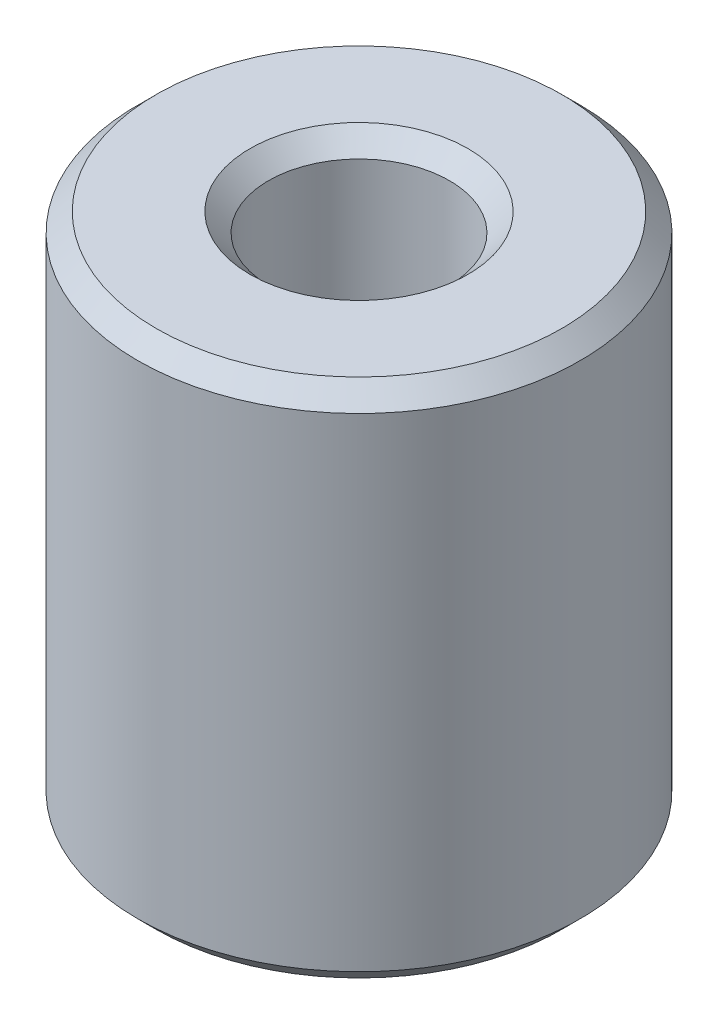
ISO-10303-21;
HEADER;
FILE_DESCRIPTION(('STEP AP214'),'2;1');
FILE_NAME('part.step','',(''),(''),'','','');
FILE_SCHEMA(('AUTOMOTIVE_DESIGN { 1 0 10303 214 1 1 1 1 }'));
ENDSEC;
DATA;
#1=APPLICATION_CONTEXT('core data for automotive mechanical design processes');
#2=APPLICATION_PROTOCOL_DEFINITION('international standard','automotive_design',2000,#1);
#3=PRODUCT_CONTEXT('',#1,'mechanical');
#4=PRODUCT('Part','Part','',(#3));
#5=PRODUCT_RELATED_PRODUCT_CATEGORY('part','',(#4));
#6=PRODUCT_DEFINITION_FORMATION('','',#4);
#7=PRODUCT_DEFINITION_CONTEXT('part definition',#1,'design');
#8=PRODUCT_DEFINITION('design','',#6,#7);
#9=PRODUCT_DEFINITION_SHAPE('','',#8);
#10=(LENGTH_UNIT() NAMED_UNIT(*) SI_UNIT(.MILLI.,.METRE.));
#11=(NAMED_UNIT(*) PLANE_ANGLE_UNIT() SI_UNIT($,.RADIAN.));
#12=(NAMED_UNIT(*) SI_UNIT($,.STERADIAN.) SOLID_ANGLE_UNIT());
#13=UNCERTAINTY_MEASURE_WITH_UNIT(LENGTH_MEASURE(1.E-05),#10,'distance_accuracy_value','');
#14=(GEOMETRIC_REPRESENTATION_CONTEXT(3) GLOBAL_UNCERTAINTY_ASSIGNED_CONTEXT((#13)) GLOBAL_UNIT_ASSIGNED_CONTEXT((#10,
#11,#12)) REPRESENTATION_CONTEXT('',''));
#15=CARTESIAN_POINT('',(0.,0.,0.));
#16=DIRECTION('',(0.,0.,1.));
#17=DIRECTION('',(1.,0.,0.));
#18=AXIS2_PLACEMENT_3D('',#15,#16,#17);
#19=CARTESIAN_POINT('',(0.,88.202172089122,0.));
#20=DIRECTION('',(0.,-1.,0.));
#21=DIRECTION('',(0.,0.,-1.));
#22=AXIS2_PLACEMENT_3D('',#19,#20,#21);
#23=CYLINDRICAL_SURFACE('',#22,37.5);
#24=CARTESIAN_POINT('',(0.,3.13711709989274,0.));
#25=DIRECTION('',(0.,1.,0.));
#26=DIRECTION('',(0.,0.,1.));
#27=AXIS2_PLACEMENT_3D('',#24,#25,#26);
#28=CIRCLE('',#27,37.5);
#29=CARTESIAN_POINT('',(0.,3.13711709989274,37.5));
#30=VERTEX_POINT('',#29);
#31=EDGE_CURVE('E10',#30,#30,#28,.T.);
#32=ORIENTED_EDGE('',*,*,#31,.T.);
#33=EDGE_LOOP('',(#32));
#34=FACE_BOUND('',#33,.T.);
#35=CARTESIAN_POINT('',(0.,85.0650549892292,0.));
#36=DIRECTION('',(0.,1.,0.));
#37=DIRECTION('',(0.,0.,1.));
#38=AXIS2_PLACEMENT_3D('',#35,#36,#37);
#39=CIRCLE('',#38,37.5);
#40=CARTESIAN_POINT('',(0.,85.0650549892292,37.5));
#41=VERTEX_POINT('',#40);
#42=EDGE_CURVE('E50',#41,#41,#39,.F.);
#43=ORIENTED_EDGE('',*,*,#42,.T.);
#44=EDGE_LOOP('',(#43));
#45=FACE_BOUND('',#44,.T.);
#46=ADVANCED_FACE('F39',(#34,#45),#23,.T.);
#47=CARTESIAN_POINT('',(0.,88.202172089122,0.));
#48=DIRECTION('',(0.,1.,0.));
#49=DIRECTION('',(0.,0.,1.));
#50=AXIS2_PLACEMENT_3D('',#47,#48,#49);
#51=PLANE('',#50);
#52=CARTESIAN_POINT('',(0.,88.202172089122,0.));
#53=DIRECTION('',(0.,1.,0.));
#54=DIRECTION('',(0.,0.,1.));
#55=AXIS2_PLACEMENT_3D('',#52,#53,#54);
#56=CIRCLE('',#55,18.4767749365389);
#57=CARTESIAN_POINT('',(0.,88.202172089122,18.4767749365389));
#58=VERTEX_POINT('',#57);
#59=EDGE_CURVE('E58',#58,#58,#56,.F.);
#60=ORIENTED_EDGE('',*,*,#59,.T.);
#61=EDGE_LOOP('',(#60));
#62=FACE_BOUND('',#61,.T.);
#63=CARTESIAN_POINT('',(0.,88.202172089122,0.));
#64=DIRECTION('',(0.,1.,0.));
#65=DIRECTION('',(0.,0.,1.));
#66=AXIS2_PLACEMENT_3D('',#63,#64,#65);
#67=CIRCLE('',#66,34.3628829001073);
#68=CARTESIAN_POINT('',(0.,88.202172089122,34.3628829001073));
#69=VERTEX_POINT('',#68);
#70=EDGE_CURVE('E61',#69,#69,#67,.T.);
#71=ORIENTED_EDGE('',*,*,#70,.T.);
#72=EDGE_LOOP('',(#71));
#73=FACE_BOUND('',#72,.T.);
#74=ADVANCED_FACE('F88',(#62,#73),#51,.T.);
#75=CARTESIAN_POINT('',(0.,0.,0.));
#76=DIRECTION('',(0.,1.,0.));
#77=DIRECTION('',(0.,0.,1.));
#78=AXIS2_PLACEMENT_3D('',#75,#76,#77);
#79=PLANE('',#78);
#80=CARTESIAN_POINT('',(0.,0.,0.));
#81=DIRECTION('',(0.,1.,0.));
#82=DIRECTION('',(0.,0.,1.));
#83=AXIS2_PLACEMENT_3D('',#80,#81,#82);
#84=CIRCLE('',#83,18.4767749365388);
#85=CARTESIAN_POINT('',(0.,0.,18.4767749365388));
#86=VERTEX_POINT('',#85);
#87=EDGE_CURVE('E51',#86,#86,#84,.T.);
#88=ORIENTED_EDGE('',*,*,#87,.T.);
#89=EDGE_LOOP('',(#88));
#90=FACE_BOUND('',#89,.T.);
#91=CARTESIAN_POINT('',(0.,0.,0.));
#92=DIRECTION('',(0.,1.,0.));
#93=DIRECTION('',(0.,0.,1.));
#94=AXIS2_PLACEMENT_3D('',#91,#92,#93);
#95=CIRCLE('',#94,34.3628829001072);
#96=CARTESIAN_POINT('',(0.,0.,34.3628829001072));
#97=VERTEX_POINT('',#96);
#98=EDGE_CURVE('E54',#97,#97,#95,.F.);
#99=ORIENTED_EDGE('',*,*,#98,.T.);
#100=EDGE_LOOP('',(#99));
#101=FACE_BOUND('',#100,.T.);
#102=ADVANCED_FACE('F83',(#90,#101),#79,.F.);
#103=CARTESIAN_POINT('',(0.,88.202172089122,0.));
#104=DIRECTION('',(0.,-1.,0.));
#105=DIRECTION('',(0.,0.,-1.));
#106=AXIS2_PLACEMENT_3D('',#103,#104,#105);
#107=CYLINDRICAL_SURFACE('',#106,15.3396578366461);
#108=CARTESIAN_POINT('',(0.,85.0650549892292,0.));
#109=DIRECTION('',(0.,1.,0.));
#110=DIRECTION('',(0.,0.,1.));
#111=AXIS2_PLACEMENT_3D('',#108,#109,#110);
#112=CIRCLE('',#111,15.3396578366461);
#113=CARTESIAN_POINT('',(0.,85.0650549892292,15.3396578366461));
#114=VERTEX_POINT('',#113);
#115=EDGE_CURVE('E67',#114,#114,#112,.T.);
#116=ORIENTED_EDGE('',*,*,#115,.T.);
#117=EDGE_LOOP('',(#116));
#118=FACE_BOUND('',#117,.T.);
#119=CARTESIAN_POINT('',(0.,3.13711709989276,0.));
#120=DIRECTION('',(0.,1.,0.));
#121=DIRECTION('',(0.,0.,1.));
#122=AXIS2_PLACEMENT_3D('',#119,#120,#121);
#123=CIRCLE('',#122,15.3396578366461);
#124=CARTESIAN_POINT('',(0.,3.13711709989276,15.3396578366461));
#125=VERTEX_POINT('',#124);
#126=EDGE_CURVE('E69',#125,#125,#123,.F.);
#127=ORIENTED_EDGE('',*,*,#126,.T.);
#128=EDGE_LOOP('',(#127));
#129=FACE_BOUND('',#128,.T.);
#130=ADVANCED_FACE('F71',(#118,#129),#107,.F.);
#131=CARTESIAN_POINT('',(0.,85.0650549892292,0.));
#132=DIRECTION('',(0.,1.,0.));
#133=DIRECTION('',(0.,0.,1.));
#134=AXIS2_PLACEMENT_3D('',#131,#132,#133);
#135=CONICAL_SURFACE('',#134,15.3396578366461,0.785398163397453);
#136=CARTESIAN_POINT('',(0.,88.202172089122,18.4767749365389));
#137=CARTESIAN_POINT('',(0.,88.1694937859981,18.444096633415));
#138=CARTESIAN_POINT('',(0.,88.1368154828742,18.4114183302911));
#139=CARTESIAN_POINT('',(0.,88.0714588766265,18.3460617240434));
#140=CARTESIAN_POINT('',(0.,88.0387805735026,18.3133834209195));
#141=CARTESIAN_POINT('',(0.,87.9734239672548,18.2480268146717));
#142=CARTESIAN_POINT('',(0.,87.9407456641309,18.2153485115478));
#143=CARTESIAN_POINT('',(0.,87.8753890578832,18.1499919053001));
#144=CARTESIAN_POINT('',(0.,87.8427107547593,18.1173136021762));
#145=CARTESIAN_POINT('',(0.,87.7773541485115,18.0519569959284));
#146=CARTESIAN_POINT('',(0.,87.7446758453876,18.0192786928045));
#147=CARTESIAN_POINT('',(0.,87.6793192391399,17.9539220865568));
#148=CARTESIAN_POINT('',(0.,87.646640936016,17.9212437834329));
#149=CARTESIAN_POINT('',(0.,87.5812843297682,17.8558871771851));
#150=CARTESIAN_POINT('',(0.,87.5486060266443,17.8232088740612));
#151=CARTESIAN_POINT('',(0.,87.4832494203966,17.7578522678135));
#152=CARTESIAN_POINT('',(0.,87.4505711172727,17.7251739646896));
#153=CARTESIAN_POINT('',(0.,87.3852145110249,17.6598173584418));
#154=CARTESIAN_POINT('',(0.,87.352536207901,17.6271390553179));
#155=CARTESIAN_POINT('',(0.,87.2871796016533,17.5617824490702));
#156=CARTESIAN_POINT('',(0.,87.2545012985294,17.5291041459463));
#157=CARTESIAN_POINT('',(0.,87.1891446922816,17.4637475396985));
#158=CARTESIAN_POINT('',(0.,87.1564663891577,17.4310692365746));
#159=CARTESIAN_POINT('',(0.,87.09110978291,17.3657126303269));
#160=CARTESIAN_POINT('',(0.,87.0584314797861,17.333034327203));
#161=CARTESIAN_POINT('',(0.,86.9930748735383,17.2676777209552));
#162=CARTESIAN_POINT('',(0.,86.9603965704144,17.2349994178313));
#163=CARTESIAN_POINT('',(0.,86.8950399641667,17.1696428115836));
#164=CARTESIAN_POINT('',(0.,86.8623616610428,17.1369645084597));
#165=CARTESIAN_POINT('',(0.,86.797005054795,17.0716079022119));
#166=CARTESIAN_POINT('',(0.,86.7643267516711,17.038929599088));
#167=CARTESIAN_POINT('',(0.,86.6989701454234,16.9735729928403));
#168=CARTESIAN_POINT('',(0.,86.6662918422995,16.9408946897164));
#169=CARTESIAN_POINT('',(0.,86.6009352360517,16.8755380834686));
#170=CARTESIAN_POINT('',(0.,86.5682569329278,16.8428597803447));
#171=CARTESIAN_POINT('',(0.,86.5029003266801,16.777503174097));
#172=CARTESIAN_POINT('',(0.,86.4702220235562,16.7448248709731));
#173=CARTESIAN_POINT('',(0.,86.4048654173084,16.6794682647253));
#174=CARTESIAN_POINT('',(0.,86.3721871141845,16.6467899616014));
#175=CARTESIAN_POINT('',(0.,86.3068305079368,16.5814333553537));
#176=CARTESIAN_POINT('',(0.,86.2741522048129,16.5487550522298));
#177=CARTESIAN_POINT('',(0.,86.2087955985651,16.483398445982));
#178=CARTESIAN_POINT('',(0.,86.1761172954412,16.4507201428581));
#179=CARTESIAN_POINT('',(0.,86.1107606891935,16.3853635366104));
#180=CARTESIAN_POINT('',(0.,86.0780823860696,16.3526852334865));
#181=CARTESIAN_POINT('',(0.,86.0127257798218,16.2873286272387));
#182=CARTESIAN_POINT('',(0.,85.9800474766979,16.2546503241148));
#183=CARTESIAN_POINT('',(0.,85.9146908704502,16.1892937178671));
#184=CARTESIAN_POINT('',(0.,85.8820125673263,16.1566154147432));
#185=CARTESIAN_POINT('',(0.,85.8166559610785,16.0912588084954));
#186=CARTESIAN_POINT('',(0.,85.7839776579547,16.0585805053715));
#187=CARTESIAN_POINT('',(0.,85.7186210517069,15.9932238991238));
#188=CARTESIAN_POINT('',(0.,85.685942748583,15.9605455959999));
#189=CARTESIAN_POINT('',(0.,85.6205861423352,15.8951889897521));
#190=CARTESIAN_POINT('',(0.,85.5879078392113,15.8625106866282));
#191=CARTESIAN_POINT('',(0.,85.5225512329636,15.7971540803805));
#192=CARTESIAN_POINT('',(0.,85.4898729298397,15.7644757772566));
#193=CARTESIAN_POINT('',(0.,85.4245163235919,15.6991191710088));
#194=CARTESIAN_POINT('',(0.,85.3918380204681,15.6664408678849));
#195=CARTESIAN_POINT('',(0.,85.3264814142203,15.6010842616372));
#196=CARTESIAN_POINT('',(0.,85.2938031110964,15.5684059585133));
#197=CARTESIAN_POINT('',(0.,85.2284465048486,15.5030493522655));
#198=CARTESIAN_POINT('',(0.,85.1957682017247,15.4703710491416));
#199=CARTESIAN_POINT('',(0.,85.130411595477,15.4050144428939));
#200=CARTESIAN_POINT('',(0.,85.0977332923531,15.37233613977));
#201=CARTESIAN_POINT('',(0.,85.0650549892292,15.3396578366461));
#202=B_SPLINE_CURVE_WITH_KNOTS('',3,(#136,#137,#138,#139,#140,#141,#142,#143,#144,#145,#146,
#147,#148,#149,#150,#151,#152,#153,#154,#155,#156,#157,#158,#159,#160,#161,#162,#163,#164,#165,
#166,#167,#168,#169,#170,#171,#172,#173,#174,#175,#176,#177,#178,#179,#180,#181,#182,#183,#184,
#185,#186,#187,#188,#189,#190,#191,#192,#193,#194,#195,#196,#197,#198,#199,#200,#201),
.UNSPECIFIED.,.F.,.F.,(4,2,2,2,2,2,2,2,2,2,2,2,2,2,2,2,2,2,2,2,2,2,2,2,2,2,2,2,2,2,2,2,4),(0.,
0.138642298419411,0.27728459683881,0.415926895258222,0.554569193677621,0.693211492097022,
0.831853790516433,0.970496088935832,1.10913838735523,1.24778068577464,1.38642298419404,
1.52506528261345,1.66370758103286,1.80234987945226,1.94099217787166,2.07963447629107,
2.21827677471047,2.35691907312987,2.49556137154928,2.63420366996868,2.77284596838808,
2.91148826680749,3.05013056522689,3.18877286364629,3.3274151620657,3.4660574604851,
3.60469975890451,3.74334205732392,3.88198435574332,4.02062665416272,4.15926895258213,
4.29791125100153,4.43655354942093),.UNSPECIFIED.);
#203=EDGE_CURVE('BSEAM77',#58,#114,#202,.T.);
#204=ORIENTED_EDGE('',*,*,#59,.F.);
#205=ORIENTED_EDGE('',*,*,#115,.F.);
#206=ORIENTED_EDGE('',*,*,#203,.T.);
#207=ORIENTED_EDGE('',*,*,#203,.F.);
#208=EDGE_LOOP('',(#204,#206,#205,#207));
#209=FACE_BOUND('',#208,.T.);
#210=ADVANCED_FACE('F77',(#209),#135,.F.);
#211=CARTESIAN_POINT('',(0.,0.,0.));
#212=DIRECTION('',(0.,-1.,0.));
#213=DIRECTION('',(0.,0.,-1.));
#214=AXIS2_PLACEMENT_3D('',#211,#212,#213);
#215=CONICAL_SURFACE('',#214,18.4767749365388,0.785398163397444);
#216=ORIENTED_EDGE('',*,*,#126,.F.);
#217=EDGE_LOOP('',(#216));
#218=FACE_BOUND('',#217,.T.);
#219=ORIENTED_EDGE('',*,*,#87,.F.);
#220=EDGE_LOOP('',(#219));
#221=FACE_BOUND('',#220,.T.);
#222=ADVANCED_FACE('F73',(#218,#221),#215,.F.);
#223=CARTESIAN_POINT('',(0.,3.13711709989274,0.));
#224=DIRECTION('',(0.,1.,0.));
#225=DIRECTION('',(0.,0.,1.));
#226=AXIS2_PLACEMENT_3D('',#223,#224,#225);
#227=CONICAL_SURFACE('',#226,37.5,0.785398163397453);
#228=ORIENTED_EDGE('',*,*,#98,.F.);
#229=EDGE_LOOP('',(#228));
#230=FACE_BOUND('',#229,.T.);
#231=ORIENTED_EDGE('',*,*,#31,.F.);
#232=EDGE_LOOP('',(#231));
#233=FACE_BOUND('',#232,.T.);
#234=ADVANCED_FACE('F76',(#230,#233),#227,.T.);
#235=CARTESIAN_POINT('',(0.,88.202172089122,0.));
#236=DIRECTION('',(0.,-1.,0.));
#237=DIRECTION('',(0.,0.,-1.));
#238=AXIS2_PLACEMENT_3D('',#235,#236,#237);
#239=CONICAL_SURFACE('',#238,34.3628829001073,0.785398163397442);
#240=ORIENTED_EDGE('',*,*,#42,.F.);
#241=EDGE_LOOP('',(#240));
#242=FACE_BOUND('',#241,.T.);
#243=ORIENTED_EDGE('',*,*,#70,.F.);
#244=EDGE_LOOP('',(#243));
#245=FACE_BOUND('',#244,.T.);
#246=ADVANCED_FACE('F45',(#242,#245),#239,.T.);
#247=CLOSED_SHELL('',(#46,#74,#102,#130,#210,#222,#234,#246));
#248=MANIFOLD_SOLID_BREP('B2',#247);
#249=ADVANCED_BREP_SHAPE_REPRESENTATION('',(#18,#248),#14);
#250=SHAPE_DEFINITION_REPRESENTATION(#9,#249);
ENDSEC;
END-ISO-10303-21;
